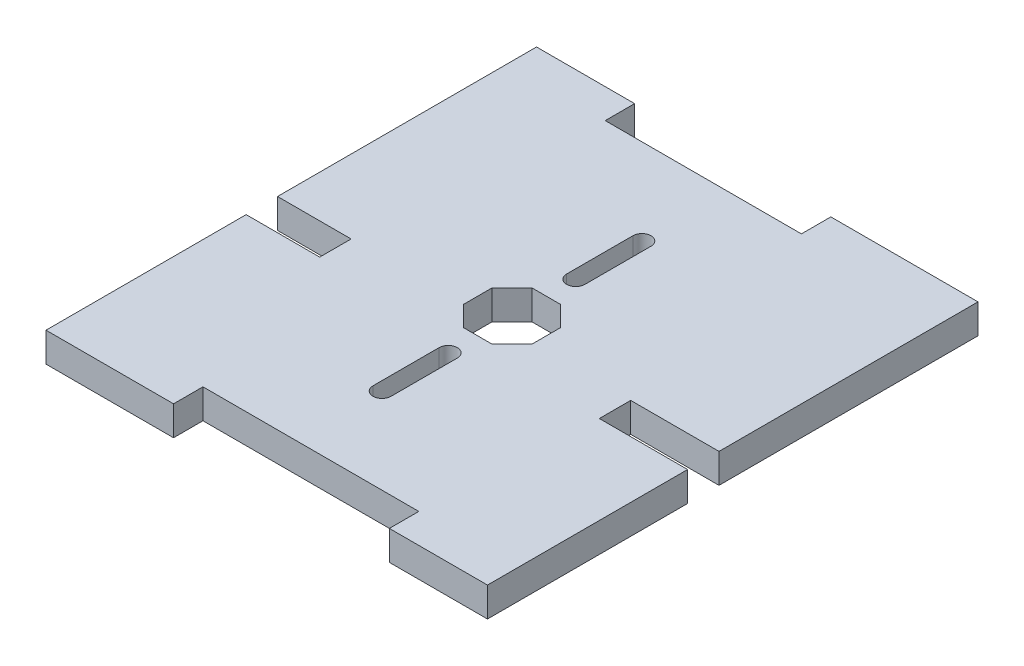
ISO-10303-21;
HEADER;
FILE_DESCRIPTION(('STEP AP214'),'2;1');
FILE_NAME('part.step','',(''),(''),'','','');
FILE_SCHEMA(('AUTOMOTIVE_DESIGN { 1 0 10303 214 1 1 1 1 }'));
ENDSEC;
DATA;
#1=APPLICATION_CONTEXT('core data for automotive mechanical design processes');
#2=APPLICATION_PROTOCOL_DEFINITION('international standard','automotive_design',2000,#1);
#3=PRODUCT_CONTEXT('',#1,'mechanical');
#4=PRODUCT('Part','Part','',(#3));
#5=PRODUCT_RELATED_PRODUCT_CATEGORY('part','',(#4));
#6=PRODUCT_DEFINITION_FORMATION('','',#4);
#7=PRODUCT_DEFINITION_CONTEXT('part definition',#1,'design');
#8=PRODUCT_DEFINITION('design','',#6,#7);
#9=PRODUCT_DEFINITION_SHAPE('','',#8);
#10=(LENGTH_UNIT() NAMED_UNIT(*) SI_UNIT(.MILLI.,.METRE.));
#11=(NAMED_UNIT(*) PLANE_ANGLE_UNIT() SI_UNIT($,.RADIAN.));
#12=(NAMED_UNIT(*) SI_UNIT($,.STERADIAN.) SOLID_ANGLE_UNIT());
#13=UNCERTAINTY_MEASURE_WITH_UNIT(LENGTH_MEASURE(1.E-05),#10,'distance_accuracy_value','');
#14=(GEOMETRIC_REPRESENTATION_CONTEXT(3) GLOBAL_UNCERTAINTY_ASSIGNED_CONTEXT((#13)) GLOBAL_UNIT_ASSIGNED_CONTEXT((#10,
#11,#12)) REPRESENTATION_CONTEXT('',''));
#15=CARTESIAN_POINT('',(0.,0.,0.));
#16=DIRECTION('',(0.,0.,1.));
#17=DIRECTION('',(1.,0.,0.));
#18=AXIS2_PLACEMENT_3D('',#15,#16,#17);
#19=CARTESIAN_POINT('',(0.,3.,0.));
#20=DIRECTION('',(1.,0.,0.));
#21=DIRECTION('',(0.,0.,-1.));
#22=AXIS2_PLACEMENT_3D('',#19,#20,#21);
#23=PLANE('',#22);
#24=DIRECTION('',(0.,0.,1.));
#25=VECTOR('',#24,1.);
#26=CARTESIAN_POINT('',(0.,0.,0.));
#27=LINE('',#26,#25);
#28=CARTESIAN_POINT('',(0.,0.,-50.));
#29=VERTEX_POINT('',#28);
#30=CARTESIAN_POINT('',(0.,0.,-23.6));
#31=VERTEX_POINT('',#30);
#32=EDGE_CURVE('E291',#29,#31,#27,.T.);
#33=ORIENTED_EDGE('',*,*,#32,.T.);
#34=DIRECTION('',(0.,1.,0.));
#35=VECTOR('',#34,1.);
#36=CARTESIAN_POINT('',(0.,0.,-23.6));
#37=LINE('',#36,#35);
#38=CARTESIAN_POINT('',(0.,3.,-23.6));
#39=VERTEX_POINT('',#38);
#40=EDGE_CURVE('E361',#31,#39,#37,.T.);
#41=ORIENTED_EDGE('',*,*,#40,.T.);
#42=DIRECTION('',(0.,0.,1.));
#43=VECTOR('',#42,1.);
#44=CARTESIAN_POINT('',(0.,3.,0.));
#45=LINE('',#44,#43);
#46=CARTESIAN_POINT('',(0.,3.,-50.));
#47=VERTEX_POINT('',#46);
#48=EDGE_CURVE('E544',#47,#39,#45,.T.);
#49=ORIENTED_EDGE('',*,*,#48,.F.);
#50=DIRECTION('',(0.,-1.,0.));
#51=VECTOR('',#50,1.);
#52=CARTESIAN_POINT('',(0.,3.,-50.));
#53=LINE('',#52,#51);
#54=EDGE_CURVE('E311',#47,#29,#53,.T.);
#55=ORIENTED_EDGE('',*,*,#54,.T.);
#56=EDGE_LOOP('',(#33,#41,#49,#55));
#57=FACE_BOUND('',#56,.T.);
#58=ADVANCED_FACE('F33',(#57),#23,.F.);
#59=CARTESIAN_POINT('',(0.,3.,0.));
#60=DIRECTION('',(0.,0.,-1.));
#61=DIRECTION('',(-1.,0.,0.));
#62=AXIS2_PLACEMENT_3D('',#59,#60,#61);
#63=PLANE('',#62);
#64=DIRECTION('',(1.,0.,0.));
#65=VECTOR('',#64,1.);
#66=CARTESIAN_POINT('',(0.,0.,0.));
#67=LINE('',#66,#65);
#68=CARTESIAN_POINT('',(0.,0.,0.));
#69=VERTEX_POINT('',#68);
#70=CARTESIAN_POINT('',(13.,0.,0.));
#71=VERTEX_POINT('',#70);
#72=EDGE_CURVE('E290',#69,#71,#67,.T.);
#73=ORIENTED_EDGE('',*,*,#72,.T.);
#74=DIRECTION('',(0.,1.,0.));
#75=VECTOR('',#74,1.);
#76=CARTESIAN_POINT('',(13.,0.,0.));
#77=LINE('',#76,#75);
#78=CARTESIAN_POINT('',(13.,3.,0.));
#79=VERTEX_POINT('',#78);
#80=EDGE_CURVE('E526',#71,#79,#77,.T.);
#81=ORIENTED_EDGE('',*,*,#80,.T.);
#82=DIRECTION('',(1.,0.,0.));
#83=VECTOR('',#82,1.);
#84=CARTESIAN_POINT('',(0.,3.,0.));
#85=LINE('',#84,#83);
#86=CARTESIAN_POINT('',(0.,3.,0.));
#87=VERTEX_POINT('',#86);
#88=EDGE_CURVE('E548',#87,#79,#85,.T.);
#89=ORIENTED_EDGE('',*,*,#88,.F.);
#90=DIRECTION('',(0.,-1.,0.));
#91=VECTOR('',#90,1.);
#92=CARTESIAN_POINT('',(0.,3.,0.));
#93=LINE('',#92,#91);
#94=EDGE_CURVE('E11',#87,#69,#93,.T.);
#95=ORIENTED_EDGE('',*,*,#94,.T.);
#96=EDGE_LOOP('',(#73,#81,#89,#95));
#97=FACE_BOUND('',#96,.T.);
#98=ADVANCED_FACE('F597',(#97),#63,.F.);
#99=CARTESIAN_POINT('',(45.,3.,0.));
#100=DIRECTION('',(-1.,0.,0.));
#101=DIRECTION('',(0.,0.,1.));
#102=AXIS2_PLACEMENT_3D('',#99,#100,#101);
#103=PLANE('',#102);
#104=DIRECTION('',(0.,0.,-1.));
#105=VECTOR('',#104,1.);
#106=CARTESIAN_POINT('',(45.,0.,0.));
#107=LINE('',#106,#105);
#108=CARTESIAN_POINT('',(45.,0.,0.));
#109=VERTEX_POINT('',#108);
#110=CARTESIAN_POINT('',(45.,0.,-20.4));
#111=VERTEX_POINT('',#110);
#112=EDGE_CURVE('E304',#109,#111,#107,.T.);
#113=ORIENTED_EDGE('',*,*,#112,.T.);
#114=DIRECTION('',(0.,1.,0.));
#115=VECTOR('',#114,1.);
#116=CARTESIAN_POINT('',(45.,0.,-20.4));
#117=LINE('',#116,#115);
#118=CARTESIAN_POINT('',(45.,3.,-20.4));
#119=VERTEX_POINT('',#118);
#120=EDGE_CURVE('E339',#111,#119,#117,.T.);
#121=ORIENTED_EDGE('',*,*,#120,.T.);
#122=DIRECTION('',(0.,0.,-1.));
#123=VECTOR('',#122,1.);
#124=CARTESIAN_POINT('',(45.,3.,0.));
#125=LINE('',#124,#123);
#126=CARTESIAN_POINT('',(45.,3.,0.));
#127=VERTEX_POINT('',#126);
#128=EDGE_CURVE('E324',#127,#119,#125,.T.);
#129=ORIENTED_EDGE('',*,*,#128,.F.);
#130=DIRECTION('',(0.,-1.,0.));
#131=VECTOR('',#130,1.);
#132=CARTESIAN_POINT('',(45.,3.,0.));
#133=LINE('',#132,#131);
#134=EDGE_CURVE('E41',#127,#109,#133,.T.);
#135=ORIENTED_EDGE('',*,*,#134,.T.);
#136=EDGE_LOOP('',(#113,#121,#129,#135));
#137=FACE_BOUND('',#136,.T.);
#138=ADVANCED_FACE('F321',(#137),#103,.F.);
#139=CARTESIAN_POINT('',(0.,3.,-50.));
#140=DIRECTION('',(0.,0.,1.));
#141=DIRECTION('',(1.,0.,0.));
#142=AXIS2_PLACEMENT_3D('',#139,#140,#141);
#143=PLANE('',#142);
#144=DIRECTION('',(-1.,0.,0.));
#145=VECTOR('',#144,1.);
#146=CARTESIAN_POINT('',(0.,3.,-50.));
#147=LINE('',#146,#145);
#148=CARTESIAN_POINT('',(10.,3.,-50.));
#149=VERTEX_POINT('',#148);
#150=EDGE_CURVE('E551',#149,#47,#147,.T.);
#151=ORIENTED_EDGE('',*,*,#150,.F.);
#152=DIRECTION('',(0.,1.,0.));
#153=VECTOR('',#152,1.);
#154=CARTESIAN_POINT('',(10.,0.,-50.));
#155=LINE('',#154,#153);
#156=CARTESIAN_POINT('',(10.,0.,-50.));
#157=VERTEX_POINT('',#156);
#158=EDGE_CURVE('E292',#157,#149,#155,.T.);
#159=ORIENTED_EDGE('',*,*,#158,.F.);
#160=DIRECTION('',(-1.,0.,0.));
#161=VECTOR('',#160,1.);
#162=CARTESIAN_POINT('',(0.,0.,-50.));
#163=LINE('',#162,#161);
#164=EDGE_CURVE('E307',#157,#29,#163,.T.);
#165=ORIENTED_EDGE('',*,*,#164,.T.);
#166=ORIENTED_EDGE('',*,*,#54,.F.);
#167=EDGE_LOOP('',(#151,#159,#165,#166));
#168=FACE_BOUND('',#167,.T.);
#169=ADVANCED_FACE('F582',(#168),#143,.F.);
#170=CARTESIAN_POINT('',(0.,3.,-20.4));
#171=VERTEX_POINT('',#170);
#172=EDGE_CURVE('E283',#171,#87,#45,.T.);
#173=ORIENTED_EDGE('',*,*,#172,.F.);
#174=DIRECTION('',(0.,1.,0.));
#175=VECTOR('',#174,1.);
#176=CARTESIAN_POINT('',(0.,0.,-20.4));
#177=LINE('',#176,#175);
#178=CARTESIAN_POINT('',(0.,0.,-20.4));
#179=VERTEX_POINT('',#178);
#180=EDGE_CURVE('E270',#179,#171,#177,.T.);
#181=ORIENTED_EDGE('',*,*,#180,.F.);
#182=EDGE_CURVE('E281',#179,#69,#27,.T.);
#183=ORIENTED_EDGE('',*,*,#182,.T.);
#184=ORIENTED_EDGE('',*,*,#94,.F.);
#185=EDGE_LOOP('',(#173,#181,#183,#184));
#186=FACE_BOUND('',#185,.T.);
#187=ADVANCED_FACE('F35',(#186),#23,.F.);
#188=CARTESIAN_POINT('',(35.,3.,0.));
#189=VERTEX_POINT('',#188);
#190=EDGE_CURVE('E547',#189,#127,#85,.T.);
#191=ORIENTED_EDGE('',*,*,#190,.F.);
#192=DIRECTION('',(0.,1.,0.));
#193=VECTOR('',#192,1.);
#194=CARTESIAN_POINT('',(35.,0.,0.));
#195=LINE('',#194,#193);
#196=CARTESIAN_POINT('',(35.,0.,0.));
#197=VERTEX_POINT('',#196);
#198=EDGE_CURVE('E538',#197,#189,#195,.T.);
#199=ORIENTED_EDGE('',*,*,#198,.F.);
#200=EDGE_CURVE('E295',#197,#109,#67,.T.);
#201=ORIENTED_EDGE('',*,*,#200,.T.);
#202=ORIENTED_EDGE('',*,*,#134,.F.);
#203=EDGE_LOOP('',(#191,#199,#201,#202));
#204=FACE_BOUND('',#203,.T.);
#205=ADVANCED_FACE('F609',(#204),#63,.F.);
#206=CARTESIAN_POINT('',(45.,3.,-23.6));
#207=VERTEX_POINT('',#206);
#208=CARTESIAN_POINT('',(45.,3.,-50.));
#209=VERTEX_POINT('',#208);
#210=EDGE_CURVE('E550',#207,#209,#125,.T.);
#211=ORIENTED_EDGE('',*,*,#210,.F.);
#212=DIRECTION('',(0.,1.,0.));
#213=VECTOR('',#212,1.);
#214=CARTESIAN_POINT('',(45.,0.,-23.6));
#215=LINE('',#214,#213);
#216=CARTESIAN_POINT('',(45.,0.,-23.6));
#217=VERTEX_POINT('',#216);
#218=EDGE_CURVE('E348',#217,#207,#215,.T.);
#219=ORIENTED_EDGE('',*,*,#218,.F.);
#220=CARTESIAN_POINT('',(45.,0.,-50.));
#221=VERTEX_POINT('',#220);
#222=EDGE_CURVE('E303',#217,#221,#107,.T.);
#223=ORIENTED_EDGE('',*,*,#222,.T.);
#224=DIRECTION('',(0.,-1.,0.));
#225=VECTOR('',#224,1.);
#226=CARTESIAN_POINT('',(45.,3.,-50.));
#227=LINE('',#226,#225);
#228=EDGE_CURVE('E314',#209,#221,#227,.T.);
#229=ORIENTED_EDGE('',*,*,#228,.F.);
#230=EDGE_LOOP('',(#211,#219,#223,#229));
#231=FACE_BOUND('',#230,.T.);
#232=ADVANCED_FACE('F563',(#231),#103,.F.);
#233=CARTESIAN_POINT('',(30.,0.,-50.));
#234=VERTEX_POINT('',#233);
#235=EDGE_CURVE('E308',#221,#234,#163,.T.);
#236=ORIENTED_EDGE('',*,*,#235,.T.);
#237=DIRECTION('',(0.,1.,0.));
#238=VECTOR('',#237,1.);
#239=CARTESIAN_POINT('',(30.,0.,-50.));
#240=LINE('',#239,#238);
#241=CARTESIAN_POINT('',(30.,3.,-50.));
#242=VERTEX_POINT('',#241);
#243=EDGE_CURVE('E296',#234,#242,#240,.T.);
#244=ORIENTED_EDGE('',*,*,#243,.T.);
#245=EDGE_CURVE('E300',#209,#242,#147,.T.);
#246=ORIENTED_EDGE('',*,*,#245,.F.);
#247=ORIENTED_EDGE('',*,*,#228,.T.);
#248=EDGE_LOOP('',(#236,#244,#246,#247));
#249=FACE_BOUND('',#248,.T.);
#250=ADVANCED_FACE('F567',(#249),#143,.F.);
#251=CARTESIAN_POINT('',(0.,3.,0.));
#252=DIRECTION('',(0.,-1.,0.));
#253=DIRECTION('',(0.,0.,-1.));
#254=AXIS2_PLACEMENT_3D('',#251,#252,#253);
#255=PLANE('',#254);
#256=DIRECTION('',(0.,0.,1.));
#257=VECTOR('',#256,1.);
#258=CARTESIAN_POINT('',(21.575,3.,-18.5));
#259=LINE('',#258,#257);
#260=CARTESIAN_POINT('',(21.575,3.,-18.5));
#261=VERTEX_POINT('',#260);
#262=CARTESIAN_POINT('',(21.575,3.,-11.75));
#263=VERTEX_POINT('',#262);
#264=EDGE_CURVE('E437',#261,#263,#259,.T.);
#265=ORIENTED_EDGE('',*,*,#264,.F.);
#266=CARTESIAN_POINT('',(22.5,3.,-18.5));
#267=DIRECTION('',(0.,1.,0.));
#268=DIRECTION('',(0.,0.,1.));
#269=AXIS2_PLACEMENT_3D('',#266,#267,#268);
#270=CIRCLE('',#269,0.925000000000002);
#271=CARTESIAN_POINT('',(23.425,3.,-18.5));
#272=VERTEX_POINT('',#271);
#273=EDGE_CURVE('E48',#272,#261,#270,.T.);
#274=ORIENTED_EDGE('',*,*,#273,.F.);
#275=DIRECTION('',(0.,0.,-1.));
#276=VECTOR('',#275,1.);
#277=CARTESIAN_POINT('',(23.425,3.,-18.5));
#278=LINE('',#277,#276);
#279=CARTESIAN_POINT('',(23.425,3.,-11.75));
#280=VERTEX_POINT('',#279);
#281=EDGE_CURVE('E426',#280,#272,#278,.T.);
#282=ORIENTED_EDGE('',*,*,#281,.F.);
#283=CARTESIAN_POINT('',(22.5,3.,-11.75));
#284=DIRECTION('',(0.,1.,0.));
#285=DIRECTION('',(0.,0.,1.));
#286=AXIS2_PLACEMENT_3D('',#283,#284,#285);
#287=CIRCLE('',#286,0.925000000000002);
#288=EDGE_CURVE('E440',#263,#280,#287,.T.);
#289=ORIENTED_EDGE('',*,*,#288,.F.);
#290=EDGE_LOOP('',(#265,#274,#282,#289));
#291=FACE_BOUND('',#290,.T.);
#292=DIRECTION('',(0.,0.,-1.));
#293=VECTOR('',#292,1.);
#294=CARTESIAN_POINT('',(23.425,3.,-31.5));
#295=LINE('',#294,#293);
#296=CARTESIAN_POINT('',(23.425,3.,-31.5));
#297=VERTEX_POINT('',#296);
#298=CARTESIAN_POINT('',(23.425,3.,-38.25));
#299=VERTEX_POINT('',#298);
#300=EDGE_CURVE('E405',#297,#299,#295,.T.);
#301=ORIENTED_EDGE('',*,*,#300,.F.);
#302=CARTESIAN_POINT('',(22.5,3.,-31.5));
#303=DIRECTION('',(0.,1.,0.));
#304=DIRECTION('',(0.,0.,1.));
#305=AXIS2_PLACEMENT_3D('',#302,#303,#304);
#306=CIRCLE('',#305,0.924999999999997);
#307=CARTESIAN_POINT('',(21.575,3.,-31.5));
#308=VERTEX_POINT('',#307);
#309=EDGE_CURVE('E56',#308,#297,#306,.T.);
#310=ORIENTED_EDGE('',*,*,#309,.F.);
#311=DIRECTION('',(0.,0.,1.));
#312=VECTOR('',#311,1.);
#313=CARTESIAN_POINT('',(21.575,3.,-31.5));
#314=LINE('',#313,#312);
#315=CARTESIAN_POINT('',(21.575,3.,-38.25));
#316=VERTEX_POINT('',#315);
#317=EDGE_CURVE('E394',#316,#308,#314,.T.);
#318=ORIENTED_EDGE('',*,*,#317,.F.);
#319=CARTESIAN_POINT('',(22.5,3.,-38.25));
#320=DIRECTION('',(0.,1.,0.));
#321=DIRECTION('',(0.,0.,1.));
#322=AXIS2_PLACEMENT_3D('',#319,#320,#321);
#323=CIRCLE('',#322,0.925);
#324=EDGE_CURVE('E409',#299,#316,#323,.T.);
#325=ORIENTED_EDGE('',*,*,#324,.F.);
#326=EDGE_LOOP('',(#301,#310,#318,#325));
#327=FACE_BOUND('',#326,.T.);
#328=DIRECTION('',(1.,0.,0.));
#329=VECTOR('',#328,1.);
#330=CARTESIAN_POINT('',(21.0502525316942,3.,-21.5));
#331=LINE('',#330,#329);
#332=CARTESIAN_POINT('',(21.0502525316942,3.,-21.5));
#333=VERTEX_POINT('',#332);
#334=CARTESIAN_POINT('',(23.9497474683058,3.,-21.5));
#335=VERTEX_POINT('',#334);
#336=EDGE_CURVE('E483',#333,#335,#331,.T.);
#337=ORIENTED_EDGE('',*,*,#336,.F.);
#338=DIRECTION('',(0.707106781186548,0.,0.707106781186548));
#339=VECTOR('',#338,1.);
#340=CARTESIAN_POINT('',(19.,3.,-23.5502525316942));
#341=LINE('',#340,#339);
#342=CARTESIAN_POINT('',(19.,3.,-23.5502525316942));
#343=VERTEX_POINT('',#342);
#344=EDGE_CURVE('E416',#343,#333,#341,.T.);
#345=ORIENTED_EDGE('',*,*,#344,.F.);
#346=DIRECTION('',(0.,0.,1.));
#347=VECTOR('',#346,1.);
#348=CARTESIAN_POINT('',(19.,3.,-26.4497474683058));
#349=LINE('',#348,#347);
#350=CARTESIAN_POINT('',(19.,3.,-26.4497474683058));
#351=VERTEX_POINT('',#350);
#352=EDGE_CURVE('E460',#351,#343,#349,.T.);
#353=ORIENTED_EDGE('',*,*,#352,.F.);
#354=DIRECTION('',(-0.707106781186547,0.,0.707106781186547));
#355=VECTOR('',#354,1.);
#356=CARTESIAN_POINT('',(21.0502525316942,3.,-28.5));
#357=LINE('',#356,#355);
#358=CARTESIAN_POINT('',(21.0502525316942,3.,-28.5));
#359=VERTEX_POINT('',#358);
#360=EDGE_CURVE('E498',#359,#351,#357,.T.);
#361=ORIENTED_EDGE('',*,*,#360,.F.);
#362=DIRECTION('',(-1.,0.,0.));
#363=VECTOR('',#362,1.);
#364=CARTESIAN_POINT('',(23.9497474683058,3.,-28.5));
#365=LINE('',#364,#363);
#366=CARTESIAN_POINT('',(23.9497474683058,3.,-28.5));
#367=VERTEX_POINT('',#366);
#368=EDGE_CURVE('E495',#367,#359,#365,.T.);
#369=ORIENTED_EDGE('',*,*,#368,.F.);
#370=DIRECTION('',(-0.707106781186548,0.,-0.707106781186548));
#371=VECTOR('',#370,1.);
#372=CARTESIAN_POINT('',(26.,3.,-26.4497474683058));
#373=LINE('',#372,#371);
#374=CARTESIAN_POINT('',(26.,3.,-26.4497474683058));
#375=VERTEX_POINT('',#374);
#376=EDGE_CURVE('E492',#375,#367,#373,.T.);
#377=ORIENTED_EDGE('',*,*,#376,.F.);
#378=DIRECTION('',(0.,0.,-1.));
#379=VECTOR('',#378,1.);
#380=CARTESIAN_POINT('',(26.,3.,-23.5502525316942));
#381=LINE('',#380,#379);
#382=CARTESIAN_POINT('',(26.,3.,-23.5502525316942));
#383=VERTEX_POINT('',#382);
#384=EDGE_CURVE('E489',#383,#375,#381,.T.);
#385=ORIENTED_EDGE('',*,*,#384,.F.);
#386=DIRECTION('',(0.707106781186547,0.,-0.707106781186547));
#387=VECTOR('',#386,1.);
#388=CARTESIAN_POINT('',(23.9497474683058,3.,-21.5));
#389=LINE('',#388,#387);
#390=EDGE_CURVE('E486',#335,#383,#389,.T.);
#391=ORIENTED_EDGE('',*,*,#390,.F.);
#392=EDGE_LOOP('',(#337,#345,#353,#361,#369,#377,#385,#391));
#393=FACE_BOUND('',#392,.T.);
#394=DIRECTION('',(0.,0.,1.));
#395=VECTOR('',#394,1.);
#396=CARTESIAN_POINT('',(36.,3.,-23.5));
#397=LINE('',#396,#395);
#398=CARTESIAN_POINT('',(36.,3.,-23.6));
#399=VERTEX_POINT('',#398);
#400=CARTESIAN_POINT('',(36.,3.,-20.4));
#401=VERTEX_POINT('',#400);
#402=EDGE_CURVE('E453',#399,#401,#397,.T.);
#403=ORIENTED_EDGE('',*,*,#402,.F.);
#404=DIRECTION('',(-1.,0.,0.));
#405=VECTOR('',#404,1.);
#406=CARTESIAN_POINT('',(45.,3.,-23.6));
#407=LINE('',#406,#405);
#408=EDGE_CURVE('E349',#207,#399,#407,.T.);
#409=ORIENTED_EDGE('',*,*,#408,.F.);
#410=ORIENTED_EDGE('',*,*,#210,.T.);
#411=ORIENTED_EDGE('',*,*,#245,.T.);
#412=DIRECTION('',(0.,0.,-1.));
#413=VECTOR('',#412,1.);
#414=CARTESIAN_POINT('',(30.,3.,-50.));
#415=LINE('',#414,#413);
#416=CARTESIAN_POINT('',(30.,3.,-47.));
#417=VERTEX_POINT('',#416);
#418=EDGE_CURVE('E370',#417,#242,#415,.T.);
#419=ORIENTED_EDGE('',*,*,#418,.F.);
#420=DIRECTION('',(1.,0.,0.));
#421=VECTOR('',#420,1.);
#422=CARTESIAN_POINT('',(10.,3.,-47.));
#423=LINE('',#422,#421);
#424=CARTESIAN_POINT('',(10.,3.,-47.));
#425=VERTEX_POINT('',#424);
#426=EDGE_CURVE('E380',#425,#417,#423,.T.);
#427=ORIENTED_EDGE('',*,*,#426,.F.);
#428=DIRECTION('',(0.,0.,1.));
#429=VECTOR('',#428,1.);
#430=CARTESIAN_POINT('',(10.,3.,-50.));
#431=LINE('',#430,#429);
#432=EDGE_CURVE('E377',#149,#425,#431,.T.);
#433=ORIENTED_EDGE('',*,*,#432,.F.);
#434=ORIENTED_EDGE('',*,*,#150,.T.);
#435=ORIENTED_EDGE('',*,*,#48,.T.);
#436=DIRECTION('',(-1.,0.,0.));
#437=VECTOR('',#436,1.);
#438=CARTESIAN_POINT('',(0.,3.,-23.6));
#439=LINE('',#438,#437);
#440=CARTESIAN_POINT('',(7.5,3.,-23.6));
#441=VERTEX_POINT('',#440);
#442=EDGE_CURVE('E359',#441,#39,#439,.T.);
#443=ORIENTED_EDGE('',*,*,#442,.F.);
#444=DIRECTION('',(0.,0.,-1.));
#445=VECTOR('',#444,1.);
#446=CARTESIAN_POINT('',(7.5,3.,-23.5));
#447=LINE('',#446,#445);
#448=CARTESIAN_POINT('',(7.5,3.,-20.4));
#449=VERTEX_POINT('',#448);
#450=EDGE_CURVE('E452',#449,#441,#447,.T.);
#451=ORIENTED_EDGE('',*,*,#450,.F.);
#452=DIRECTION('',(1.,0.,0.));
#453=VECTOR('',#452,1.);
#454=CARTESIAN_POINT('',(0.,3.,-20.4));
#455=LINE('',#454,#453);
#456=EDGE_CURVE('E276',#171,#449,#455,.T.);
#457=ORIENTED_EDGE('',*,*,#456,.F.);
#458=ORIENTED_EDGE('',*,*,#172,.T.);
#459=ORIENTED_EDGE('',*,*,#88,.T.);
#460=DIRECTION('',(0.,0.,1.));
#461=VECTOR('',#460,1.);
#462=CARTESIAN_POINT('',(13.,3.,0.));
#463=LINE('',#462,#461);
#464=CARTESIAN_POINT('',(13.,3.,-3.));
#465=VERTEX_POINT('',#464);
#466=EDGE_CURVE('E527',#465,#79,#463,.T.);
#467=ORIENTED_EDGE('',*,*,#466,.F.);
#468=DIRECTION('',(-1.,0.,0.));
#469=VECTOR('',#468,1.);
#470=CARTESIAN_POINT('',(13.,3.,-3.));
#471=LINE('',#470,#469);
#472=CARTESIAN_POINT('',(35.,3.,-3.));
#473=VERTEX_POINT('',#472);
#474=EDGE_CURVE('E521',#473,#465,#471,.T.);
#475=ORIENTED_EDGE('',*,*,#474,.F.);
#476=DIRECTION('',(0.,0.,-1.));
#477=VECTOR('',#476,1.);
#478=CARTESIAN_POINT('',(35.,3.,0.));
#479=LINE('',#478,#477);
#480=EDGE_CURVE('E529',#189,#473,#479,.T.);
#481=ORIENTED_EDGE('',*,*,#480,.F.);
#482=ORIENTED_EDGE('',*,*,#190,.T.);
#483=ORIENTED_EDGE('',*,*,#128,.T.);
#484=DIRECTION('',(1.,0.,0.));
#485=VECTOR('',#484,1.);
#486=CARTESIAN_POINT('',(45.,3.,-20.4));
#487=LINE('',#486,#485);
#488=EDGE_CURVE('E337',#401,#119,#487,.T.);
#489=ORIENTED_EDGE('',*,*,#488,.F.);
#490=EDGE_LOOP('',(#403,#409,#410,#411,#419,#427,#433,#434,#435,#443,#451,#457,#458,#459,#467,
#475,#481,#482,#483,#489));
#491=FACE_BOUND('',#490,.T.);
#492=ADVANCED_FACE('F558',(#291,#327,#393,#491),#255,.F.);
#493=CARTESIAN_POINT('',(0.,0.,0.));
#494=DIRECTION('',(0.,-1.,0.));
#495=DIRECTION('',(0.,0.,-1.));
#496=AXIS2_PLACEMENT_3D('',#493,#494,#495);
#497=PLANE('',#496);
#498=DIRECTION('',(-1.,0.,0.));
#499=VECTOR('',#498,1.);
#500=CARTESIAN_POINT('',(45.,0.,-23.6));
#501=LINE('',#500,#499);
#502=CARTESIAN_POINT('',(36.,0.,-23.6));
#503=VERTEX_POINT('',#502);
#504=EDGE_CURVE('E346',#217,#503,#501,.T.);
#505=ORIENTED_EDGE('',*,*,#504,.T.);
#506=DIRECTION('',(0.,0.,1.));
#507=VECTOR('',#506,1.);
#508=CARTESIAN_POINT('',(36.,0.,-23.5));
#509=LINE('',#508,#507);
#510=CARTESIAN_POINT('',(36.,0.,-20.4));
#511=VERTEX_POINT('',#510);
#512=EDGE_CURVE('E332',#503,#511,#509,.T.);
#513=ORIENTED_EDGE('',*,*,#512,.T.);
#514=DIRECTION('',(1.,0.,0.));
#515=VECTOR('',#514,1.);
#516=CARTESIAN_POINT('',(45.,0.,-20.4));
#517=LINE('',#516,#515);
#518=EDGE_CURVE('E331',#511,#111,#517,.T.);
#519=ORIENTED_EDGE('',*,*,#518,.T.);
#520=ORIENTED_EDGE('',*,*,#112,.F.);
#521=ORIENTED_EDGE('',*,*,#200,.F.);
#522=DIRECTION('',(0.,0.,-1.));
#523=VECTOR('',#522,1.);
#524=CARTESIAN_POINT('',(35.,0.,0.));
#525=LINE('',#524,#523);
#526=CARTESIAN_POINT('',(35.,0.,-3.));
#527=VERTEX_POINT('',#526);
#528=EDGE_CURVE('E520',#197,#527,#525,.T.);
#529=ORIENTED_EDGE('',*,*,#528,.T.);
#530=DIRECTION('',(-1.,0.,0.));
#531=VECTOR('',#530,1.);
#532=CARTESIAN_POINT('',(13.,0.,-3.));
#533=LINE('',#532,#531);
#534=CARTESIAN_POINT('',(13.,0.,-3.));
#535=VERTEX_POINT('',#534);
#536=EDGE_CURVE('E523',#527,#535,#533,.T.);
#537=ORIENTED_EDGE('',*,*,#536,.T.);
#538=DIRECTION('',(0.,0.,1.));
#539=VECTOR('',#538,1.);
#540=CARTESIAN_POINT('',(13.,0.,0.));
#541=LINE('',#540,#539);
#542=EDGE_CURVE('E518',#535,#71,#541,.T.);
#543=ORIENTED_EDGE('',*,*,#542,.T.);
#544=ORIENTED_EDGE('',*,*,#72,.F.);
#545=ORIENTED_EDGE('',*,*,#182,.F.);
#546=DIRECTION('',(1.,0.,0.));
#547=VECTOR('',#546,1.);
#548=CARTESIAN_POINT('',(0.,0.,-20.4));
#549=LINE('',#548,#547);
#550=CARTESIAN_POINT('',(7.5,0.,-20.4));
#551=VERTEX_POINT('',#550);
#552=EDGE_CURVE('E266',#179,#551,#549,.T.);
#553=ORIENTED_EDGE('',*,*,#552,.T.);
#554=DIRECTION('',(0.,0.,-1.));
#555=VECTOR('',#554,1.);
#556=CARTESIAN_POINT('',(7.5,0.,-23.5));
#557=LINE('',#556,#555);
#558=CARTESIAN_POINT('',(7.5,0.,-23.6));
#559=VERTEX_POINT('',#558);
#560=EDGE_CURVE('E530',#551,#559,#557,.T.);
#561=ORIENTED_EDGE('',*,*,#560,.T.);
#562=DIRECTION('',(-1.,0.,0.));
#563=VECTOR('',#562,1.);
#564=CARTESIAN_POINT('',(0.,0.,-23.6));
#565=LINE('',#564,#563);
#566=EDGE_CURVE('E355',#559,#31,#565,.T.);
#567=ORIENTED_EDGE('',*,*,#566,.T.);
#568=ORIENTED_EDGE('',*,*,#32,.F.);
#569=ORIENTED_EDGE('',*,*,#164,.F.);
#570=DIRECTION('',(0.,0.,1.));
#571=VECTOR('',#570,1.);
#572=CARTESIAN_POINT('',(10.,0.,-50.));
#573=LINE('',#572,#571);
#574=CARTESIAN_POINT('',(10.,0.,-47.));
#575=VERTEX_POINT('',#574);
#576=EDGE_CURVE('E366',#157,#575,#573,.T.);
#577=ORIENTED_EDGE('',*,*,#576,.T.);
#578=DIRECTION('',(1.,0.,0.));
#579=VECTOR('',#578,1.);
#580=CARTESIAN_POINT('',(10.,0.,-47.));
#581=LINE('',#580,#579);
#582=CARTESIAN_POINT('',(30.,0.,-47.));
#583=VERTEX_POINT('',#582);
#584=EDGE_CURVE('E369',#575,#583,#581,.T.);
#585=ORIENTED_EDGE('',*,*,#584,.T.);
#586=DIRECTION('',(0.,0.,-1.));
#587=VECTOR('',#586,1.);
#588=CARTESIAN_POINT('',(30.,0.,-50.));
#589=LINE('',#588,#587);
#590=EDGE_CURVE('E373',#583,#234,#589,.T.);
#591=ORIENTED_EDGE('',*,*,#590,.T.);
#592=ORIENTED_EDGE('',*,*,#235,.F.);
#593=ORIENTED_EDGE('',*,*,#222,.F.);
#594=EDGE_LOOP('',(#505,#513,#519,#520,#521,#529,#537,#543,#544,#545,#553,#561,#567,#568,#569,
#577,#585,#591,#592,#593));
#595=FACE_BOUND('',#594,.T.);
#596=CARTESIAN_POINT('',(22.5,0.,-18.5));
#597=DIRECTION('',(0.,1.,0.));
#598=DIRECTION('',(0.,0.,1.));
#599=AXIS2_PLACEMENT_3D('',#596,#597,#598);
#600=CIRCLE('',#599,0.925000000000002);
#601=CARTESIAN_POINT('',(23.425,0.,-18.5));
#602=VERTEX_POINT('',#601);
#603=CARTESIAN_POINT('',(21.575,0.,-18.5));
#604=VERTEX_POINT('',#603);
#605=EDGE_CURVE('E422',#602,#604,#600,.T.);
#606=ORIENTED_EDGE('',*,*,#605,.T.);
#607=DIRECTION('',(0.,0.,1.));
#608=VECTOR('',#607,1.);
#609=CARTESIAN_POINT('',(21.575,0.,-18.5));
#610=LINE('',#609,#608);
#611=CARTESIAN_POINT('',(21.575,0.,-11.75));
#612=VERTEX_POINT('',#611);
#613=EDGE_CURVE('E425',#604,#612,#610,.T.);
#614=ORIENTED_EDGE('',*,*,#613,.T.);
#615=CARTESIAN_POINT('',(22.5,0.,-11.75));
#616=DIRECTION('',(0.,1.,0.));
#617=DIRECTION('',(0.,0.,1.));
#618=AXIS2_PLACEMENT_3D('',#615,#616,#617);
#619=CIRCLE('',#618,0.925000000000002);
#620=CARTESIAN_POINT('',(23.425,0.,-11.75));
#621=VERTEX_POINT('',#620);
#622=EDGE_CURVE('E429',#612,#621,#619,.T.);
#623=ORIENTED_EDGE('',*,*,#622,.T.);
#624=DIRECTION('',(0.,0.,-1.));
#625=VECTOR('',#624,1.);
#626=CARTESIAN_POINT('',(23.425,0.,-18.5));
#627=LINE('',#626,#625);
#628=EDGE_CURVE('E432',#621,#602,#627,.T.);
#629=ORIENTED_EDGE('',*,*,#628,.T.);
#630=EDGE_LOOP('',(#606,#614,#623,#629));
#631=FACE_BOUND('',#630,.T.);
#632=CARTESIAN_POINT('',(22.5,0.,-31.5));
#633=DIRECTION('',(0.,1.,0.));
#634=DIRECTION('',(0.,0.,1.));
#635=AXIS2_PLACEMENT_3D('',#632,#633,#634);
#636=CIRCLE('',#635,0.924999999999997);
#637=CARTESIAN_POINT('',(21.575,0.,-31.5));
#638=VERTEX_POINT('',#637);
#639=CARTESIAN_POINT('',(23.425,0.,-31.5));
#640=VERTEX_POINT('',#639);
#641=EDGE_CURVE('E390',#638,#640,#636,.T.);
#642=ORIENTED_EDGE('',*,*,#641,.T.);
#643=DIRECTION('',(0.,0.,-1.));
#644=VECTOR('',#643,1.);
#645=CARTESIAN_POINT('',(23.425,0.,-31.5));
#646=LINE('',#645,#644);
#647=CARTESIAN_POINT('',(23.425,0.,-38.25));
#648=VERTEX_POINT('',#647);
#649=EDGE_CURVE('E393',#640,#648,#646,.T.);
#650=ORIENTED_EDGE('',*,*,#649,.T.);
#651=CARTESIAN_POINT('',(22.5,0.,-38.25));
#652=DIRECTION('',(0.,1.,0.));
#653=DIRECTION('',(0.,0.,1.));
#654=AXIS2_PLACEMENT_3D('',#651,#652,#653);
#655=CIRCLE('',#654,0.925);
#656=CARTESIAN_POINT('',(21.575,0.,-38.25));
#657=VERTEX_POINT('',#656);
#658=EDGE_CURVE('E397',#648,#657,#655,.T.);
#659=ORIENTED_EDGE('',*,*,#658,.T.);
#660=DIRECTION('',(0.,0.,1.));
#661=VECTOR('',#660,1.);
#662=CARTESIAN_POINT('',(21.575,0.,-31.5));
#663=LINE('',#662,#661);
#664=EDGE_CURVE('E400',#657,#638,#663,.T.);
#665=ORIENTED_EDGE('',*,*,#664,.T.);
#666=EDGE_LOOP('',(#642,#650,#659,#665));
#667=FACE_BOUND('',#666,.T.);
#668=DIRECTION('',(0.707106781186548,0.,0.707106781186548));
#669=VECTOR('',#668,1.);
#670=CARTESIAN_POINT('',(19.,0.,-23.5502525316942));
#671=LINE('',#670,#669);
#672=CARTESIAN_POINT('',(19.,0.,-23.5502525316942));
#673=VERTEX_POINT('',#672);
#674=CARTESIAN_POINT('',(21.0502525316942,0.,-21.5));
#675=VERTEX_POINT('',#674);
#676=EDGE_CURVE('E456',#673,#675,#671,.T.);
#677=ORIENTED_EDGE('',*,*,#676,.T.);
#678=DIRECTION('',(1.,0.,0.));
#679=VECTOR('',#678,1.);
#680=CARTESIAN_POINT('',(21.0502525316942,0.,-21.5));
#681=LINE('',#680,#679);
#682=CARTESIAN_POINT('',(23.9497474683058,0.,-21.5));
#683=VERTEX_POINT('',#682);
#684=EDGE_CURVE('E459',#675,#683,#681,.T.);
#685=ORIENTED_EDGE('',*,*,#684,.T.);
#686=DIRECTION('',(0.707106781186547,0.,-0.707106781186547));
#687=VECTOR('',#686,1.);
#688=CARTESIAN_POINT('',(23.9497474683058,0.,-21.5));
#689=LINE('',#688,#687);
#690=CARTESIAN_POINT('',(26.,0.,-23.5502525316942));
#691=VERTEX_POINT('',#690);
#692=EDGE_CURVE('E463',#683,#691,#689,.T.);
#693=ORIENTED_EDGE('',*,*,#692,.T.);
#694=DIRECTION('',(0.,0.,-1.));
#695=VECTOR('',#694,1.);
#696=CARTESIAN_POINT('',(26.,0.,-23.5502525316942));
#697=LINE('',#696,#695);
#698=CARTESIAN_POINT('',(26.,0.,-26.4497474683058));
#699=VERTEX_POINT('',#698);
#700=EDGE_CURVE('E466',#691,#699,#697,.T.);
#701=ORIENTED_EDGE('',*,*,#700,.T.);
#702=DIRECTION('',(-0.707106781186548,0.,-0.707106781186548));
#703=VECTOR('',#702,1.);
#704=CARTESIAN_POINT('',(26.,0.,-26.4497474683058));
#705=LINE('',#704,#703);
#706=CARTESIAN_POINT('',(23.9497474683058,0.,-28.5));
#707=VERTEX_POINT('',#706);
#708=EDGE_CURVE('E469',#699,#707,#705,.T.);
#709=ORIENTED_EDGE('',*,*,#708,.T.);
#710=DIRECTION('',(-1.,0.,0.));
#711=VECTOR('',#710,1.);
#712=CARTESIAN_POINT('',(23.9497474683058,0.,-28.5));
#713=LINE('',#712,#711);
#714=CARTESIAN_POINT('',(21.0502525316942,0.,-28.5));
#715=VERTEX_POINT('',#714);
#716=EDGE_CURVE('E472',#707,#715,#713,.T.);
#717=ORIENTED_EDGE('',*,*,#716,.T.);
#718=DIRECTION('',(-0.707106781186547,0.,0.707106781186547));
#719=VECTOR('',#718,1.);
#720=CARTESIAN_POINT('',(21.0502525316942,0.,-28.5));
#721=LINE('',#720,#719);
#722=CARTESIAN_POINT('',(19.,0.,-26.4497474683058));
#723=VERTEX_POINT('',#722);
#724=EDGE_CURVE('E475',#715,#723,#721,.T.);
#725=ORIENTED_EDGE('',*,*,#724,.T.);
#726=DIRECTION('',(0.,0.,1.));
#727=VECTOR('',#726,1.);
#728=CARTESIAN_POINT('',(19.,0.,-26.4497474683058));
#729=LINE('',#728,#727);
#730=EDGE_CURVE('E478',#723,#673,#729,.T.);
#731=ORIENTED_EDGE('',*,*,#730,.T.);
#732=EDGE_LOOP('',(#677,#685,#693,#701,#709,#717,#725,#731));
#733=FACE_BOUND('',#732,.T.);
#734=ADVANCED_FACE('F286',(#595,#631,#667,#733),#497,.T.);
#735=CARTESIAN_POINT('',(19.,0.,-23.5502525316942));
#736=DIRECTION('',(-0.707106781186547,0.,0.707106781186547));
#737=DIRECTION('',(0.707106781186548,0.,0.707106781186548));
#738=AXIS2_PLACEMENT_3D('',#735,#736,#737);
#739=PLANE('',#738);
#740=ORIENTED_EDGE('',*,*,#344,.T.);
#741=DIRECTION('',(0.,1.,0.));
#742=VECTOR('',#741,1.);
#743=CARTESIAN_POINT('',(21.0502525316942,0.,-21.5));
#744=LINE('',#743,#742);
#745=EDGE_CURVE('E481',#675,#333,#744,.T.);
#746=ORIENTED_EDGE('',*,*,#745,.F.);
#747=ORIENTED_EDGE('',*,*,#676,.F.);
#748=DIRECTION('',(0.,1.,0.));
#749=VECTOR('',#748,1.);
#750=CARTESIAN_POINT('',(19.,0.,-23.5502525316942));
#751=LINE('',#750,#749);
#752=EDGE_CURVE('E455',#673,#343,#751,.T.);
#753=ORIENTED_EDGE('',*,*,#752,.T.);
#754=EDGE_LOOP('',(#740,#746,#747,#753));
#755=FACE_BOUND('',#754,.T.);
#756=ADVANCED_FACE('F667',(#755),#739,.F.);
#757=CARTESIAN_POINT('',(19.,0.,-26.4497474683058));
#758=DIRECTION('',(-1.,0.,0.));
#759=DIRECTION('',(0.,0.,1.));
#760=AXIS2_PLACEMENT_3D('',#757,#758,#759);
#761=PLANE('',#760);
#762=ORIENTED_EDGE('',*,*,#352,.T.);
#763=ORIENTED_EDGE('',*,*,#752,.F.);
#764=ORIENTED_EDGE('',*,*,#730,.F.);
#765=DIRECTION('',(0.,1.,0.));
#766=VECTOR('',#765,1.);
#767=CARTESIAN_POINT('',(19.,0.,-26.4497474683058));
#768=LINE('',#767,#766);
#769=EDGE_CURVE('E504',#723,#351,#768,.T.);
#770=ORIENTED_EDGE('',*,*,#769,.T.);
#771=EDGE_LOOP('',(#762,#763,#764,#770));
#772=FACE_BOUND('',#771,.T.);
#773=ADVANCED_FACE('F768',(#772),#761,.F.);
#774=CARTESIAN_POINT('',(21.0502525316942,0.,-28.5));
#775=DIRECTION('',(-0.707106781186548,0.,-0.707106781186548));
#776=DIRECTION('',(-0.707106781186548,0.,0.707106781186548));
#777=AXIS2_PLACEMENT_3D('',#774,#775,#776);
#778=PLANE('',#777);
#779=ORIENTED_EDGE('',*,*,#360,.T.);
#780=ORIENTED_EDGE('',*,*,#769,.F.);
#781=ORIENTED_EDGE('',*,*,#724,.F.);
#782=DIRECTION('',(0.,1.,0.));
#783=VECTOR('',#782,1.);
#784=CARTESIAN_POINT('',(21.0502525316942,0.,-28.5));
#785=LINE('',#784,#783);
#786=EDGE_CURVE('E506',#715,#359,#785,.T.);
#787=ORIENTED_EDGE('',*,*,#786,.T.);
#788=EDGE_LOOP('',(#779,#780,#781,#787));
#789=FACE_BOUND('',#788,.T.);
#790=ADVANCED_FACE('F771',(#789),#778,.F.);
#791=CARTESIAN_POINT('',(23.9497474683058,0.,-28.5));
#792=DIRECTION('',(0.,0.,-1.));
#793=DIRECTION('',(-1.,0.,0.));
#794=AXIS2_PLACEMENT_3D('',#791,#792,#793);
#795=PLANE('',#794);
#796=ORIENTED_EDGE('',*,*,#368,.T.);
#797=ORIENTED_EDGE('',*,*,#786,.F.);
#798=ORIENTED_EDGE('',*,*,#716,.F.);
#799=DIRECTION('',(0.,1.,0.));
#800=VECTOR('',#799,1.);
#801=CARTESIAN_POINT('',(23.9497474683058,0.,-28.5));
#802=LINE('',#801,#800);
#803=EDGE_CURVE('E508',#707,#367,#802,.T.);
#804=ORIENTED_EDGE('',*,*,#803,.T.);
#805=EDGE_LOOP('',(#796,#797,#798,#804));
#806=FACE_BOUND('',#805,.T.);
#807=ADVANCED_FACE('F775',(#806),#795,.F.);
#808=CARTESIAN_POINT('',(26.,0.,-26.4497474683058));
#809=DIRECTION('',(0.707106781186547,0.,-0.707106781186547));
#810=DIRECTION('',(-0.707106781186548,0.,-0.707106781186548));
#811=AXIS2_PLACEMENT_3D('',#808,#809,#810);
#812=PLANE('',#811);
#813=ORIENTED_EDGE('',*,*,#376,.T.);
#814=ORIENTED_EDGE('',*,*,#803,.F.);
#815=ORIENTED_EDGE('',*,*,#708,.F.);
#816=DIRECTION('',(0.,1.,0.));
#817=VECTOR('',#816,1.);
#818=CARTESIAN_POINT('',(26.,0.,-26.4497474683058));
#819=LINE('',#818,#817);
#820=EDGE_CURVE('E510',#699,#375,#819,.T.);
#821=ORIENTED_EDGE('',*,*,#820,.T.);
#822=EDGE_LOOP('',(#813,#814,#815,#821));
#823=FACE_BOUND('',#822,.T.);
#824=ADVANCED_FACE('F779',(#823),#812,.F.);
#825=CARTESIAN_POINT('',(26.,0.,-23.5502525316942));
#826=DIRECTION('',(1.,0.,0.));
#827=DIRECTION('',(0.,0.,-1.));
#828=AXIS2_PLACEMENT_3D('',#825,#826,#827);
#829=PLANE('',#828);
#830=ORIENTED_EDGE('',*,*,#384,.T.);
#831=ORIENTED_EDGE('',*,*,#820,.F.);
#832=ORIENTED_EDGE('',*,*,#700,.F.);
#833=DIRECTION('',(0.,1.,0.));
#834=VECTOR('',#833,1.);
#835=CARTESIAN_POINT('',(26.,0.,-23.5502525316942));
#836=LINE('',#835,#834);
#837=EDGE_CURVE('E512',#691,#383,#836,.T.);
#838=ORIENTED_EDGE('',*,*,#837,.T.);
#839=EDGE_LOOP('',(#830,#831,#832,#838));
#840=FACE_BOUND('',#839,.T.);
#841=ADVANCED_FACE('F783',(#840),#829,.F.);
#842=CARTESIAN_POINT('',(23.9497474683058,0.,-21.5));
#843=DIRECTION('',(0.707106781186548,0.,0.707106781186548));
#844=DIRECTION('',(0.707106781186548,0.,-0.707106781186548));
#845=AXIS2_PLACEMENT_3D('',#842,#843,#844);
#846=PLANE('',#845);
#847=ORIENTED_EDGE('',*,*,#390,.T.);
#848=ORIENTED_EDGE('',*,*,#837,.F.);
#849=ORIENTED_EDGE('',*,*,#692,.F.);
#850=DIRECTION('',(0.,1.,0.));
#851=VECTOR('',#850,1.);
#852=CARTESIAN_POINT('',(23.9497474683058,0.,-21.5));
#853=LINE('',#852,#851);
#854=EDGE_CURVE('E514',#683,#335,#853,.T.);
#855=ORIENTED_EDGE('',*,*,#854,.T.);
#856=EDGE_LOOP('',(#847,#848,#849,#855));
#857=FACE_BOUND('',#856,.T.);
#858=ADVANCED_FACE('F787',(#857),#846,.F.);
#859=CARTESIAN_POINT('',(21.0502525316942,0.,-21.5));
#860=DIRECTION('',(0.,0.,1.));
#861=DIRECTION('',(1.,0.,0.));
#862=AXIS2_PLACEMENT_3D('',#859,#860,#861);
#863=PLANE('',#862);
#864=ORIENTED_EDGE('',*,*,#336,.T.);
#865=ORIENTED_EDGE('',*,*,#854,.F.);
#866=ORIENTED_EDGE('',*,*,#684,.F.);
#867=ORIENTED_EDGE('',*,*,#745,.T.);
#868=EDGE_LOOP('',(#864,#865,#866,#867));
#869=FACE_BOUND('',#868,.T.);
#870=ADVANCED_FACE('F678',(#869),#863,.F.);
#871=CARTESIAN_POINT('',(36.,0.,-23.5));
#872=DIRECTION('',(-1.,0.,0.));
#873=DIRECTION('',(0.,0.,1.));
#874=AXIS2_PLACEMENT_3D('',#871,#872,#873);
#875=PLANE('',#874);
#876=ORIENTED_EDGE('',*,*,#402,.T.);
#877=DIRECTION('',(0.,1.,0.));
#878=VECTOR('',#877,1.);
#879=CARTESIAN_POINT('',(36.,0.,-20.4));
#880=LINE('',#879,#878);
#881=EDGE_CURVE('E336',#511,#401,#880,.T.);
#882=ORIENTED_EDGE('',*,*,#881,.F.);
#883=ORIENTED_EDGE('',*,*,#512,.F.);
#884=DIRECTION('',(0.,1.,0.));
#885=VECTOR('',#884,1.);
#886=CARTESIAN_POINT('',(36.,0.,-23.6));
#887=LINE('',#886,#885);
#888=EDGE_CURVE('E341',#503,#399,#887,.T.);
#889=ORIENTED_EDGE('',*,*,#888,.T.);
#890=EDGE_LOOP('',(#876,#882,#883,#889));
#891=FACE_BOUND('',#890,.T.);
#892=ADVANCED_FACE('F673',(#891),#875,.F.);
#893=CARTESIAN_POINT('',(7.5,0.,-23.5));
#894=DIRECTION('',(1.,0.,0.));
#895=DIRECTION('',(0.,0.,-1.));
#896=AXIS2_PLACEMENT_3D('',#893,#894,#895);
#897=PLANE('',#896);
#898=ORIENTED_EDGE('',*,*,#450,.T.);
#899=DIRECTION('',(0.,1.,0.));
#900=VECTOR('',#899,1.);
#901=CARTESIAN_POINT('',(7.5,0.,-23.6));
#902=LINE('',#901,#900);
#903=EDGE_CURVE('E358',#559,#441,#902,.T.);
#904=ORIENTED_EDGE('',*,*,#903,.F.);
#905=ORIENTED_EDGE('',*,*,#560,.F.);
#906=DIRECTION('',(0.,1.,0.));
#907=VECTOR('',#906,1.);
#908=CARTESIAN_POINT('',(7.5,0.,-20.4));
#909=LINE('',#908,#907);
#910=EDGE_CURVE('E273',#551,#449,#909,.T.);
#911=ORIENTED_EDGE('',*,*,#910,.T.);
#912=EDGE_LOOP('',(#898,#904,#905,#911));
#913=FACE_BOUND('',#912,.T.);
#914=ADVANCED_FACE('F592',(#913),#897,.F.);
#915=CARTESIAN_POINT('',(13.,0.,0.));
#916=DIRECTION('',(-1.,0.,0.));
#917=DIRECTION('',(0.,0.,1.));
#918=AXIS2_PLACEMENT_3D('',#915,#916,#917);
#919=PLANE('',#918);
#920=ORIENTED_EDGE('',*,*,#466,.T.);
#921=ORIENTED_EDGE('',*,*,#80,.F.);
#922=ORIENTED_EDGE('',*,*,#542,.F.);
#923=DIRECTION('',(0.,1.,0.));
#924=VECTOR('',#923,1.);
#925=CARTESIAN_POINT('',(13.,0.,-3.));
#926=LINE('',#925,#924);
#927=EDGE_CURVE('E381',#535,#465,#926,.T.);
#928=ORIENTED_EDGE('',*,*,#927,.T.);
#929=EDGE_LOOP('',(#920,#921,#922,#928));
#930=FACE_BOUND('',#929,.T.);
#931=ADVANCED_FACE('F600',(#930),#919,.F.);
#932=CARTESIAN_POINT('',(13.,0.,-3.));
#933=DIRECTION('',(0.,0.,-1.));
#934=DIRECTION('',(-1.,0.,0.));
#935=AXIS2_PLACEMENT_3D('',#932,#933,#934);
#936=PLANE('',#935);
#937=ORIENTED_EDGE('',*,*,#474,.T.);
#938=ORIENTED_EDGE('',*,*,#927,.F.);
#939=ORIENTED_EDGE('',*,*,#536,.F.);
#940=DIRECTION('',(0.,1.,0.));
#941=VECTOR('',#940,1.);
#942=CARTESIAN_POINT('',(35.,0.,-3.));
#943=LINE('',#942,#941);
#944=EDGE_CURVE('E536',#527,#473,#943,.T.);
#945=ORIENTED_EDGE('',*,*,#944,.T.);
#946=EDGE_LOOP('',(#937,#938,#939,#945));
#947=FACE_BOUND('',#946,.T.);
#948=ADVANCED_FACE('F603',(#947),#936,.F.);
#949=CARTESIAN_POINT('',(35.,0.,0.));
#950=DIRECTION('',(1.,0.,0.));
#951=DIRECTION('',(0.,0.,-1.));
#952=AXIS2_PLACEMENT_3D('',#949,#950,#951);
#953=PLANE('',#952);
#954=ORIENTED_EDGE('',*,*,#480,.T.);
#955=ORIENTED_EDGE('',*,*,#944,.F.);
#956=ORIENTED_EDGE('',*,*,#528,.F.);
#957=ORIENTED_EDGE('',*,*,#198,.T.);
#958=EDGE_LOOP('',(#954,#955,#956,#957));
#959=FACE_BOUND('',#958,.T.);
#960=ADVANCED_FACE('F605',(#959),#953,.F.);
#961=CARTESIAN_POINT('',(22.5,0.,-31.5));
#962=DIRECTION('',(0.,1.,0.));
#963=DIRECTION('',(0.,0.,1.));
#964=AXIS2_PLACEMENT_3D('',#961,#962,#963);
#965=CYLINDRICAL_SURFACE('',#964,0.924999999999997);
#966=ORIENTED_EDGE('',*,*,#309,.T.);
#967=DIRECTION('',(0.,1.,0.));
#968=VECTOR('',#967,1.);
#969=CARTESIAN_POINT('',(23.425,0.,-31.5));
#970=LINE('',#969,#968);
#971=EDGE_CURVE('E403',#640,#297,#970,.T.);
#972=ORIENTED_EDGE('',*,*,#971,.F.);
#973=ORIENTED_EDGE('',*,*,#641,.F.);
#974=DIRECTION('',(0.,1.,0.));
#975=VECTOR('',#974,1.);
#976=CARTESIAN_POINT('',(21.575,0.,-31.5));
#977=LINE('',#976,#975);
#978=EDGE_CURVE('E414',#638,#308,#977,.T.);
#979=ORIENTED_EDGE('',*,*,#978,.T.);
#980=EDGE_LOOP('',(#966,#972,#973,#979));
#981=FACE_BOUND('',#980,.T.);
#982=ADVANCED_FACE('F743',(#981),#965,.F.);
#983=CARTESIAN_POINT('',(21.575,0.,-31.5));
#984=DIRECTION('',(-1.,0.,0.));
#985=DIRECTION('',(0.,0.,1.));
#986=AXIS2_PLACEMENT_3D('',#983,#984,#985);
#987=PLANE('',#986);
#988=ORIENTED_EDGE('',*,*,#317,.T.);
#989=ORIENTED_EDGE('',*,*,#978,.F.);
#990=ORIENTED_EDGE('',*,*,#664,.F.);
#991=DIRECTION('',(0.,1.,0.));
#992=VECTOR('',#991,1.);
#993=CARTESIAN_POINT('',(21.575,0.,-38.25));
#994=LINE('',#993,#992);
#995=EDGE_CURVE('E417',#657,#316,#994,.T.);
#996=ORIENTED_EDGE('',*,*,#995,.T.);
#997=EDGE_LOOP('',(#988,#989,#990,#996));
#998=FACE_BOUND('',#997,.T.);
#999=ADVANCED_FACE('F739',(#998),#987,.F.);
#1000=CARTESIAN_POINT('',(22.5,0.,-38.25));
#1001=DIRECTION('',(0.,1.,0.));
#1002=DIRECTION('',(0.,0.,1.));
#1003=AXIS2_PLACEMENT_3D('',#1000,#1001,#1002);
#1004=CYLINDRICAL_SURFACE('',#1003,0.925);
#1005=ORIENTED_EDGE('',*,*,#324,.T.);
#1006=ORIENTED_EDGE('',*,*,#995,.F.);
#1007=ORIENTED_EDGE('',*,*,#658,.F.);
#1008=DIRECTION('',(0.,1.,0.));
#1009=VECTOR('',#1008,1.);
#1010=CARTESIAN_POINT('',(23.425,0.,-38.25));
#1011=LINE('',#1010,#1009);
#1012=EDGE_CURVE('E419',#648,#299,#1011,.T.);
#1013=ORIENTED_EDGE('',*,*,#1012,.T.);
#1014=EDGE_LOOP('',(#1005,#1006,#1007,#1013));
#1015=FACE_BOUND('',#1014,.T.);
#1016=ADVANCED_FACE('F742',(#1015),#1004,.F.);
#1017=CARTESIAN_POINT('',(23.425,0.,-31.5));
#1018=DIRECTION('',(1.,0.,0.));
#1019=DIRECTION('',(0.,0.,-1.));
#1020=AXIS2_PLACEMENT_3D('',#1017,#1018,#1019);
#1021=PLANE('',#1020);
#1022=ORIENTED_EDGE('',*,*,#300,.T.);
#1023=ORIENTED_EDGE('',*,*,#1012,.F.);
#1024=ORIENTED_EDGE('',*,*,#649,.F.);
#1025=ORIENTED_EDGE('',*,*,#971,.T.);
#1026=EDGE_LOOP('',(#1022,#1023,#1024,#1025));
#1027=FACE_BOUND('',#1026,.T.);
#1028=ADVANCED_FACE('F747',(#1027),#1021,.F.);
#1029=CARTESIAN_POINT('',(22.5,0.,-18.5));
#1030=DIRECTION('',(0.,1.,0.));
#1031=DIRECTION('',(0.,0.,1.));
#1032=AXIS2_PLACEMENT_3D('',#1029,#1030,#1031);
#1033=CYLINDRICAL_SURFACE('',#1032,0.925000000000002);
#1034=ORIENTED_EDGE('',*,*,#273,.T.);
#1035=DIRECTION('',(0.,1.,0.));
#1036=VECTOR('',#1035,1.);
#1037=CARTESIAN_POINT('',(21.575,0.,-18.5));
#1038=LINE('',#1037,#1036);
#1039=EDGE_CURVE('E435',#604,#261,#1038,.T.);
#1040=ORIENTED_EDGE('',*,*,#1039,.F.);
#1041=ORIENTED_EDGE('',*,*,#605,.F.);
#1042=DIRECTION('',(0.,1.,0.));
#1043=VECTOR('',#1042,1.);
#1044=CARTESIAN_POINT('',(23.425,0.,-18.5));
#1045=LINE('',#1044,#1043);
#1046=EDGE_CURVE('E406',#602,#272,#1045,.T.);
#1047=ORIENTED_EDGE('',*,*,#1046,.T.);
#1048=EDGE_LOOP('',(#1034,#1040,#1041,#1047));
#1049=FACE_BOUND('',#1048,.T.);
#1050=ADVANCED_FACE('F751',(#1049),#1033,.F.);
#1051=CARTESIAN_POINT('',(23.425,0.,-18.5));
#1052=DIRECTION('',(1.,0.,0.));
#1053=DIRECTION('',(0.,0.,-1.));
#1054=AXIS2_PLACEMENT_3D('',#1051,#1052,#1053);
#1055=PLANE('',#1054);
#1056=ORIENTED_EDGE('',*,*,#281,.T.);
#1057=ORIENTED_EDGE('',*,*,#1046,.F.);
#1058=ORIENTED_EDGE('',*,*,#628,.F.);
#1059=DIRECTION('',(0.,1.,0.));
#1060=VECTOR('',#1059,1.);
#1061=CARTESIAN_POINT('',(23.425,0.,-11.75));
#1062=LINE('',#1061,#1060);
#1063=EDGE_CURVE('E446',#621,#280,#1062,.T.);
#1064=ORIENTED_EDGE('',*,*,#1063,.T.);
#1065=EDGE_LOOP('',(#1056,#1057,#1058,#1064));
#1066=FACE_BOUND('',#1065,.T.);
#1067=ADVANCED_FACE('F755',(#1066),#1055,.F.);
#1068=CARTESIAN_POINT('',(22.5,0.,-11.75));
#1069=DIRECTION('',(0.,1.,0.));
#1070=DIRECTION('',(0.,0.,1.));
#1071=AXIS2_PLACEMENT_3D('',#1068,#1069,#1070);
#1072=CYLINDRICAL_SURFACE('',#1071,0.925000000000002);
#1073=ORIENTED_EDGE('',*,*,#288,.T.);
#1074=ORIENTED_EDGE('',*,*,#1063,.F.);
#1075=ORIENTED_EDGE('',*,*,#622,.F.);
#1076=DIRECTION('',(0.,1.,0.));
#1077=VECTOR('',#1076,1.);
#1078=CARTESIAN_POINT('',(21.575,0.,-11.75));
#1079=LINE('',#1078,#1077);
#1080=EDGE_CURVE('E448',#612,#263,#1079,.T.);
#1081=ORIENTED_EDGE('',*,*,#1080,.T.);
#1082=EDGE_LOOP('',(#1073,#1074,#1075,#1081));
#1083=FACE_BOUND('',#1082,.T.);
#1084=ADVANCED_FACE('F758',(#1083),#1072,.F.);
#1085=CARTESIAN_POINT('',(21.575,0.,-18.5));
#1086=DIRECTION('',(-1.,0.,0.));
#1087=DIRECTION('',(0.,0.,1.));
#1088=AXIS2_PLACEMENT_3D('',#1085,#1086,#1087);
#1089=PLANE('',#1088);
#1090=ORIENTED_EDGE('',*,*,#264,.T.);
#1091=ORIENTED_EDGE('',*,*,#1080,.F.);
#1092=ORIENTED_EDGE('',*,*,#613,.F.);
#1093=ORIENTED_EDGE('',*,*,#1039,.T.);
#1094=EDGE_LOOP('',(#1090,#1091,#1092,#1093));
#1095=FACE_BOUND('',#1094,.T.);
#1096=ADVANCED_FACE('F738',(#1095),#1089,.F.);
#1097=CARTESIAN_POINT('',(10.,0.,-50.));
#1098=DIRECTION('',(-1.,0.,0.));
#1099=DIRECTION('',(0.,0.,1.));
#1100=AXIS2_PLACEMENT_3D('',#1097,#1098,#1099);
#1101=PLANE('',#1100);
#1102=ORIENTED_EDGE('',*,*,#432,.T.);
#1103=DIRECTION('',(0.,1.,0.));
#1104=VECTOR('',#1103,1.);
#1105=CARTESIAN_POINT('',(10.,0.,-47.));
#1106=LINE('',#1105,#1104);
#1107=EDGE_CURVE('E376',#575,#425,#1106,.T.);
#1108=ORIENTED_EDGE('',*,*,#1107,.F.);
#1109=ORIENTED_EDGE('',*,*,#576,.F.);
#1110=ORIENTED_EDGE('',*,*,#158,.T.);
#1111=EDGE_LOOP('',(#1102,#1108,#1109,#1110));
#1112=FACE_BOUND('',#1111,.T.);
#1113=ADVANCED_FACE('F734',(#1112),#1101,.F.);
#1114=CARTESIAN_POINT('',(30.,0.,-50.));
#1115=DIRECTION('',(1.,0.,0.));
#1116=DIRECTION('',(0.,0.,-1.));
#1117=AXIS2_PLACEMENT_3D('',#1114,#1115,#1116);
#1118=PLANE('',#1117);
#1119=ORIENTED_EDGE('',*,*,#418,.T.);
#1120=ORIENTED_EDGE('',*,*,#243,.F.);
#1121=ORIENTED_EDGE('',*,*,#590,.F.);
#1122=DIRECTION('',(0.,1.,0.));
#1123=VECTOR('',#1122,1.);
#1124=CARTESIAN_POINT('',(30.,0.,-47.));
#1125=LINE('',#1124,#1123);
#1126=EDGE_CURVE('E387',#583,#417,#1125,.T.);
#1127=ORIENTED_EDGE('',*,*,#1126,.T.);
#1128=EDGE_LOOP('',(#1119,#1120,#1121,#1127));
#1129=FACE_BOUND('',#1128,.T.);
#1130=ADVANCED_FACE('F569',(#1129),#1118,.F.);
#1131=CARTESIAN_POINT('',(10.,0.,-47.));
#1132=DIRECTION('',(0.,0.,1.));
#1133=DIRECTION('',(1.,0.,0.));
#1134=AXIS2_PLACEMENT_3D('',#1131,#1132,#1133);
#1135=PLANE('',#1134);
#1136=ORIENTED_EDGE('',*,*,#426,.T.);
#1137=ORIENTED_EDGE('',*,*,#1126,.F.);
#1138=ORIENTED_EDGE('',*,*,#584,.F.);
#1139=ORIENTED_EDGE('',*,*,#1107,.T.);
#1140=EDGE_LOOP('',(#1136,#1137,#1138,#1139));
#1141=FACE_BOUND('',#1140,.T.);
#1142=ADVANCED_FACE('F574',(#1141),#1135,.F.);
#1143=CARTESIAN_POINT('',(0.,0.,-20.4));
#1144=DIRECTION('',(0.,0.,1.));
#1145=DIRECTION('',(1.,0.,0.));
#1146=AXIS2_PLACEMENT_3D('',#1143,#1144,#1145);
#1147=PLANE('',#1146);
#1148=ORIENTED_EDGE('',*,*,#456,.T.);
#1149=ORIENTED_EDGE('',*,*,#910,.F.);
#1150=ORIENTED_EDGE('',*,*,#552,.F.);
#1151=ORIENTED_EDGE('',*,*,#180,.T.);
#1152=EDGE_LOOP('',(#1148,#1149,#1150,#1151));
#1153=FACE_BOUND('',#1152,.T.);
#1154=ADVANCED_FACE('F269',(#1153),#1147,.F.);
#1155=CARTESIAN_POINT('',(0.,0.,-23.6));
#1156=DIRECTION('',(0.,0.,-1.));
#1157=DIRECTION('',(-1.,0.,0.));
#1158=AXIS2_PLACEMENT_3D('',#1155,#1156,#1157);
#1159=PLANE('',#1158);
#1160=ORIENTED_EDGE('',*,*,#442,.T.);
#1161=ORIENTED_EDGE('',*,*,#40,.F.);
#1162=ORIENTED_EDGE('',*,*,#566,.F.);
#1163=ORIENTED_EDGE('',*,*,#903,.T.);
#1164=EDGE_LOOP('',(#1160,#1161,#1162,#1163));
#1165=FACE_BOUND('',#1164,.T.);
#1166=ADVANCED_FACE('F588',(#1165),#1159,.F.);
#1167=CARTESIAN_POINT('',(45.,0.,-23.6));
#1168=DIRECTION('',(0.,0.,-1.));
#1169=DIRECTION('',(-1.,0.,0.));
#1170=AXIS2_PLACEMENT_3D('',#1167,#1168,#1169);
#1171=PLANE('',#1170);
#1172=ORIENTED_EDGE('',*,*,#408,.T.);
#1173=ORIENTED_EDGE('',*,*,#888,.F.);
#1174=ORIENTED_EDGE('',*,*,#504,.F.);
#1175=ORIENTED_EDGE('',*,*,#218,.T.);
#1176=EDGE_LOOP('',(#1172,#1173,#1174,#1175));
#1177=FACE_BOUND('',#1176,.T.);
#1178=ADVANCED_FACE('F709',(#1177),#1171,.F.);
#1179=CARTESIAN_POINT('',(45.,0.,-20.4));
#1180=DIRECTION('',(0.,0.,1.));
#1181=DIRECTION('',(1.,0.,0.));
#1182=AXIS2_PLACEMENT_3D('',#1179,#1180,#1181);
#1183=PLANE('',#1182);
#1184=ORIENTED_EDGE('',*,*,#488,.T.);
#1185=ORIENTED_EDGE('',*,*,#120,.F.);
#1186=ORIENTED_EDGE('',*,*,#518,.F.);
#1187=ORIENTED_EDGE('',*,*,#881,.T.);
#1188=EDGE_LOOP('',(#1184,#1185,#1186,#1187));
#1189=FACE_BOUND('',#1188,.T.);
#1190=ADVANCED_FACE('F718',(#1189),#1183,.F.);
#1191=CLOSED_SHELL('',(#58,#98,#138,#169,#187,#205,#232,#250,#492,#734,#756,#773,#790,#807,#824,
#841,#858,#870,#892,#914,#931,#948,#960,#982,#999,#1016,#1028,#1050,#1067,#1084,#1096,#1113,
#1130,#1142,#1154,#1166,#1178,#1190));
#1192=MANIFOLD_SOLID_BREP('B2',#1191);
#1193=ADVANCED_BREP_SHAPE_REPRESENTATION('',(#18,#1192),#14);
#1194=SHAPE_DEFINITION_REPRESENTATION(#9,#1193);
ENDSEC;
END-ISO-10303-21;
